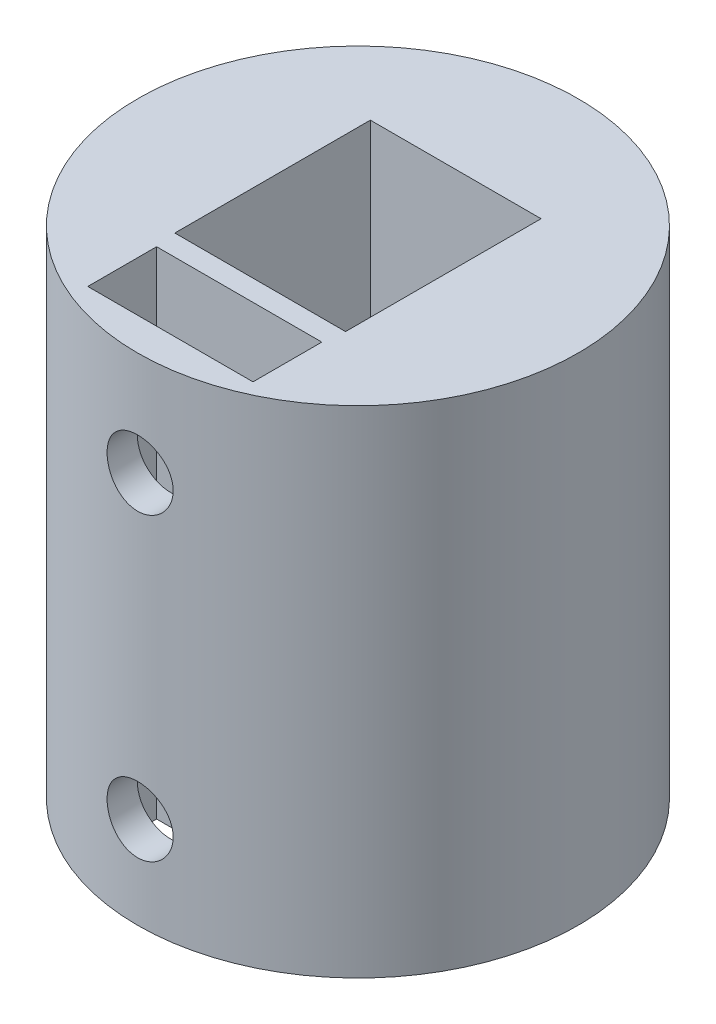
ISO-10303-21;
HEADER;
FILE_DESCRIPTION(('STEP AP214'),'2;1');
FILE_NAME('part.step','',(''),(''),'','','');
FILE_SCHEMA(('AUTOMOTIVE_DESIGN { 1 0 10303 214 1 1 1 1 }'));
ENDSEC;
DATA;
#1=APPLICATION_CONTEXT('core data for automotive mechanical design processes');
#2=APPLICATION_PROTOCOL_DEFINITION('international standard','automotive_design',2000,#1);
#3=PRODUCT_CONTEXT('',#1,'mechanical');
#4=PRODUCT('Part','Part','',(#3));
#5=PRODUCT_RELATED_PRODUCT_CATEGORY('part','',(#4));
#6=PRODUCT_DEFINITION_FORMATION('','',#4);
#7=PRODUCT_DEFINITION_CONTEXT('part definition',#1,'design');
#8=PRODUCT_DEFINITION('design','',#6,#7);
#9=PRODUCT_DEFINITION_SHAPE('','',#8);
#10=(LENGTH_UNIT() NAMED_UNIT(*) SI_UNIT(.MILLI.,.METRE.));
#11=(NAMED_UNIT(*) PLANE_ANGLE_UNIT() SI_UNIT($,.RADIAN.));
#12=(NAMED_UNIT(*) SI_UNIT($,.STERADIAN.) SOLID_ANGLE_UNIT());
#13=UNCERTAINTY_MEASURE_WITH_UNIT(LENGTH_MEASURE(1.E-05),#10,'distance_accuracy_value','');
#14=(GEOMETRIC_REPRESENTATION_CONTEXT(3) GLOBAL_UNCERTAINTY_ASSIGNED_CONTEXT((#13)) GLOBAL_UNIT_ASSIGNED_CONTEXT((#10,
#11,#12)) REPRESENTATION_CONTEXT('',''));
#15=CARTESIAN_POINT('',(0.,0.,0.));
#16=DIRECTION('',(0.,0.,1.));
#17=DIRECTION('',(1.,0.,0.));
#18=AXIS2_PLACEMENT_3D('',#15,#16,#17);
#19=CARTESIAN_POINT('',(0.,18.,0.));
#20=DIRECTION('',(0.,1.,0.));
#21=DIRECTION('',(0.,0.,1.));
#22=AXIS2_PLACEMENT_3D('',#19,#20,#21);
#23=PLANE('',#22);
#24=DIRECTION('',(0.,0.,-1.));
#25=VECTOR('',#24,1.);
#26=CARTESIAN_POINT('',(3.1,18.,-3.55));
#27=LINE('',#26,#25);
#28=CARTESIAN_POINT('',(3.1,18.,3.55));
#29=VERTEX_POINT('',#28);
#30=CARTESIAN_POINT('',(3.1,18.,-3.55));
#31=VERTEX_POINT('',#30);
#32=EDGE_CURVE('E123',#29,#31,#27,.T.);
#33=ORIENTED_EDGE('',*,*,#32,.F.);
#34=DIRECTION('',(1.,0.,0.));
#35=VECTOR('',#34,1.);
#36=CARTESIAN_POINT('',(-3.1,18.,3.55));
#37=LINE('',#36,#35);
#38=CARTESIAN_POINT('',(-3.1,18.,3.55));
#39=VERTEX_POINT('',#38);
#40=EDGE_CURVE('E158',#39,#29,#37,.T.);
#41=ORIENTED_EDGE('',*,*,#40,.F.);
#42=DIRECTION('',(0.,0.,1.));
#43=VECTOR('',#42,1.);
#44=CARTESIAN_POINT('',(-3.1,18.,-3.55));
#45=LINE('',#44,#43);
#46=CARTESIAN_POINT('',(-3.1,18.,-3.55));
#47=VERTEX_POINT('',#46);
#48=EDGE_CURVE('E172',#47,#39,#45,.T.);
#49=ORIENTED_EDGE('',*,*,#48,.F.);
#50=DIRECTION('',(-1.,0.,0.));
#51=VECTOR('',#50,1.);
#52=CARTESIAN_POINT('',(-3.1,18.,-3.55));
#53=LINE('',#52,#51);
#54=EDGE_CURVE('E169',#31,#47,#53,.T.);
#55=ORIENTED_EDGE('',*,*,#54,.F.);
#56=EDGE_LOOP('',(#33,#41,#49,#55));
#57=FACE_BOUND('',#56,.T.);
#58=CARTESIAN_POINT('',(0.,18.,0.));
#59=DIRECTION('',(0.,1.,0.));
#60=DIRECTION('',(0.,0.,1.));
#61=AXIS2_PLACEMENT_3D('',#58,#59,#60);
#62=CIRCLE('',#61,8.);
#63=CARTESIAN_POINT('',(0.,18.,8.));
#64=VERTEX_POINT('',#63);
#65=EDGE_CURVE('E202',#64,#64,#62,.T.);
#66=ORIENTED_EDGE('',*,*,#65,.T.);
#67=EDGE_LOOP('',(#66));
#68=FACE_BOUND('',#67,.T.);
#69=DIRECTION('',(-1.,0.,0.));
#70=VECTOR('',#69,1.);
#71=CARTESIAN_POINT('',(3.,18.,6.8115824668048));
#72=LINE('',#71,#70);
#73=CARTESIAN_POINT('',(3.,18.,6.8115824668048));
#74=VERTEX_POINT('',#73);
#75=CARTESIAN_POINT('',(-3.,18.,6.8115824668048));
#76=VERTEX_POINT('',#75);
#77=EDGE_CURVE('E136',#74,#76,#72,.T.);
#78=ORIENTED_EDGE('',*,*,#77,.T.);
#79=DIRECTION('',(0.,0.,-1.));
#80=VECTOR('',#79,1.);
#81=CARTESIAN_POINT('',(-3.,18.,6.8115824668048));
#82=LINE('',#81,#80);
#83=CARTESIAN_POINT('',(-3.,18.,4.3115824668048));
#84=VERTEX_POINT('',#83);
#85=EDGE_CURVE('E57',#76,#84,#82,.T.);
#86=ORIENTED_EDGE('',*,*,#85,.T.);
#87=DIRECTION('',(1.,0.,0.));
#88=VECTOR('',#87,1.);
#89=CARTESIAN_POINT('',(-3.,18.,4.3115824668048));
#90=LINE('',#89,#88);
#91=CARTESIAN_POINT('',(3.,18.,4.3115824668048));
#92=VERTEX_POINT('',#91);
#93=EDGE_CURVE('E127',#84,#92,#90,.T.);
#94=ORIENTED_EDGE('',*,*,#93,.T.);
#95=DIRECTION('',(0.,0.,1.));
#96=VECTOR('',#95,1.);
#97=CARTESIAN_POINT('',(3.,18.,4.3115824668048));
#98=LINE('',#97,#96);
#99=EDGE_CURVE('E133',#92,#74,#98,.T.);
#100=ORIENTED_EDGE('',*,*,#99,.T.);
#101=EDGE_LOOP('',(#78,#86,#94,#100));
#102=FACE_BOUND('',#101,.T.);
#103=ADVANCED_FACE('F39',(#57,#68,#102),#23,.T.);
#104=CARTESIAN_POINT('',(0.,0.,0.));
#105=DIRECTION('',(0.,1.,0.));
#106=DIRECTION('',(0.,0.,1.));
#107=AXIS2_PLACEMENT_3D('',#104,#105,#106);
#108=PLANE('',#107);
#109=CARTESIAN_POINT('',(0.,0.,0.));
#110=DIRECTION('',(0.,1.,0.));
#111=DIRECTION('',(0.,0.,1.));
#112=AXIS2_PLACEMENT_3D('',#109,#110,#111);
#113=CIRCLE('',#112,8.);
#114=CARTESIAN_POINT('',(0.,0.,8.));
#115=VERTEX_POINT('',#114);
#116=EDGE_CURVE('E199',#115,#115,#113,.T.);
#117=ORIENTED_EDGE('',*,*,#116,.F.);
#118=EDGE_LOOP('',(#117));
#119=FACE_BOUND('',#118,.T.);
#120=DIRECTION('',(-1.,0.,0.));
#121=VECTOR('',#120,1.);
#122=CARTESIAN_POINT('',(-1.50127177756507,0.,1.39595238095238));
#123=LINE('',#122,#121);
#124=CARTESIAN_POINT('',(1.50127177756507,0.,1.39595238095238));
#125=VERTEX_POINT('',#124);
#126=CARTESIAN_POINT('',(-1.50127177756507,0.,1.39595238095238));
#127=VERTEX_POINT('',#126);
#128=EDGE_CURVE('E190',#125,#127,#123,.T.);
#129=ORIENTED_EDGE('',*,*,#128,.F.);
#130=CARTESIAN_POINT('',(0.,0.,0.));
#131=DIRECTION('',(0.,-1.,0.));
#132=DIRECTION('',(0.,0.,-1.));
#133=AXIS2_PLACEMENT_3D('',#130,#131,#132);
#134=CIRCLE('',#133,2.05);
#135=EDGE_CURVE('E179',#127,#125,#134,.T.);
#136=ORIENTED_EDGE('',*,*,#135,.F.);
#137=EDGE_LOOP('',(#129,#136));
#138=FACE_BOUND('',#137,.T.);
#139=DIRECTION('',(0.,0.,-1.));
#140=VECTOR('',#139,1.);
#141=CARTESIAN_POINT('',(-3.,0.,0.));
#142=LINE('',#141,#140);
#143=CARTESIAN_POINT('',(-3.,0.,6.8115824668048));
#144=VERTEX_POINT('',#143);
#145=CARTESIAN_POINT('',(-3.,0.,4.3115824668048));
#146=VERTEX_POINT('',#145);
#147=EDGE_CURVE('E11',#144,#146,#142,.T.);
#148=ORIENTED_EDGE('',*,*,#147,.F.);
#149=DIRECTION('',(-1.,0.,0.));
#150=VECTOR('',#149,1.);
#151=CARTESIAN_POINT('',(0.,0.,6.8115824668048));
#152=LINE('',#151,#150);
#153=CARTESIAN_POINT('',(3.,0.,6.8115824668048));
#154=VERTEX_POINT('',#153);
#155=EDGE_CURVE('E205',#154,#144,#152,.T.);
#156=ORIENTED_EDGE('',*,*,#155,.F.);
#157=DIRECTION('',(0.,0.,1.));
#158=VECTOR('',#157,1.);
#159=CARTESIAN_POINT('',(3.,0.,0.));
#160=LINE('',#159,#158);
#161=CARTESIAN_POINT('',(3.,0.,4.3115824668048));
#162=VERTEX_POINT('',#161);
#163=EDGE_CURVE('E209',#162,#154,#160,.T.);
#164=ORIENTED_EDGE('',*,*,#163,.F.);
#165=DIRECTION('',(1.,0.,0.));
#166=VECTOR('',#165,1.);
#167=CARTESIAN_POINT('',(0.,0.,4.3115824668048));
#168=LINE('',#167,#166);
#169=EDGE_CURVE('E49',#146,#162,#168,.T.);
#170=ORIENTED_EDGE('',*,*,#169,.F.);
#171=EDGE_LOOP('',(#148,#156,#164,#170));
#172=FACE_BOUND('',#171,.T.);
#173=ADVANCED_FACE('F285',(#119,#138,#172),#108,.F.);
#174=CARTESIAN_POINT('',(0.,18.,0.));
#175=DIRECTION('',(0.,-1.,0.));
#176=DIRECTION('',(0.,0.,-1.));
#177=AXIS2_PLACEMENT_3D('',#174,#175,#176);
#178=CYLINDRICAL_SURFACE('',#177,8.);
#179=CARTESIAN_POINT('',(1.2,3.32833392560161,7.90948797331408));
#180=CARTESIAN_POINT('',(1.19999723285827,3.26133747016965,7.90948909334874));
#181=CARTESIAN_POINT('',(1.19437037110793,3.19430212500104,7.91034841391281));
#182=CARTESIAN_POINT('',(1.17201757325601,3.06210567369511,7.91369051842592));
#183=CARTESIAN_POINT('',(1.15528081122102,2.9969464604176,7.91617488585144));
#184=CARTESIAN_POINT('',(1.11122020878467,2.87043492124409,7.92247951188982));
#185=CARTESIAN_POINT('',(1.08390449345118,2.80907971556788,7.92629874505229));
#186=CARTESIAN_POINT('',(1.01948050470233,2.69183230098395,7.93484155290516));
#187=CARTESIAN_POINT('',(0.982373579438974,2.63593934143017,7.93956500306935));
#188=CARTESIAN_POINT('',(0.899103219348467,2.53074687219815,7.94942631398432));
#189=CARTESIAN_POINT('',(0.852876844678562,2.48149743487622,7.95456689966446));
#190=CARTESIAN_POINT('',(0.7528156843555,2.39142393707721,7.96465894535238));
#191=CARTESIAN_POINT('',(0.698980480629224,2.35060033986802,7.96961039494892));
#192=CARTESIAN_POINT('',(0.584909086442197,2.27835262024852,7.97879477942548));
#193=CARTESIAN_POINT('',(0.524643381892614,2.24697460534364,7.98302414748455));
#194=CARTESIAN_POINT('',(0.39962308008558,2.19480464655507,7.99025765397124));
#195=CARTESIAN_POINT('',(0.334868720216543,2.1740121433273,7.99326185713555));
#196=CARTESIAN_POINT('',(0.203224898472456,2.14375521477694,7.99768731838225));
#197=CARTESIAN_POINT('',(0.136355107511894,2.13420694449188,7.99912028709875));
#198=CARTESIAN_POINT('',(0.00194816321558356,2.1264491777417,8.00028195815667));
#199=CARTESIAN_POINT('',(-0.0655889528125968,2.12823905094586,8.00001075523952));
#200=CARTESIAN_POINT('',(-0.198841374560416,2.14304059581156,7.99780399728636));
#201=CARTESIAN_POINT('',(-0.264566953120006,2.1559620630348,7.99588182121983));
#202=CARTESIAN_POINT('',(-0.39290626331451,2.19251841065967,7.99060400182281));
#203=CARTESIAN_POINT('',(-0.455519914810785,2.21615356680276,7.98724832159791));
#204=CARTESIAN_POINT('',(-0.576131024616253,2.27355872313529,7.97945755098564));
#205=CARTESIAN_POINT('',(-0.634110137858877,2.3073666976886,7.97501842812511));
#206=CARTESIAN_POINT('',(-0.743606325720142,2.3841300805376,7.96555550596337));
#207=CARTESIAN_POINT('',(-0.795122974617388,2.4270860909671,7.96053166818547));
#208=CARTESIAN_POINT('',(-0.890763586178117,2.52142868466288,7.95040126554101));
#209=CARTESIAN_POINT('',(-0.934809863607573,2.5728940231777,7.94529437298605));
#210=CARTESIAN_POINT('',(-1.0136527947105,2.6825267873006,7.93562163562818));
#211=CARTESIAN_POINT('',(-1.04844939142399,2.74069425417755,7.93105579415719));
#212=CARTESIAN_POINT('',(-1.10781571627684,2.86216109595413,7.92298220229484));
#213=CARTESIAN_POINT('',(-1.13237745816065,2.92546443253152,7.91947527876233));
#214=CARTESIAN_POINT('',(-1.17049868967103,3.05536212971952,7.91393122319247));
#215=CARTESIAN_POINT('',(-1.18405895469861,3.12195625803901,7.91189398757039));
#216=CARTESIAN_POINT('',(-1.19968576069324,3.2558539972636,7.90953961116021));
#217=CARTESIAN_POINT('',(-1.20186242612042,3.32314447616284,7.90920599042059));
#218=CARTESIAN_POINT('',(-1.19495245615855,3.45712928145548,7.91025286349722));
#219=CARTESIAN_POINT('',(-1.18586617025842,3.52382362628222,7.91163330412623));
#220=CARTESIAN_POINT('',(-1.15678162362213,3.65438177997412,7.91593761969162));
#221=CARTESIAN_POINT('',(-1.13683822822257,3.71825808955489,7.91885373186286));
#222=CARTESIAN_POINT('',(-1.08666265557669,3.8417611992405,7.92589441460614));
#223=CARTESIAN_POINT('',(-1.05642997021111,3.90138778930417,7.93001904485741));
#224=CARTESIAN_POINT('',(-0.986269423962588,4.01519253386965,7.9390508454965));
#225=CARTESIAN_POINT('',(-0.946270276494129,4.06932628342547,7.9439636742399));
#226=CARTESIAN_POINT('',(-0.857811334697611,4.17015221350066,7.95400127546684));
#227=CARTESIAN_POINT('',(-0.809351061957436,4.21684397294653,7.95912605992234));
#228=CARTESIAN_POINT('',(-0.704860495702547,4.30185601090848,7.96906164173909));
#229=CARTESIAN_POINT('',(-0.648770501417565,4.34010330819559,7.97386946768339));
#230=CARTESIAN_POINT('',(-0.530897664210944,4.40663224981173,7.98258324025612));
#231=CARTESIAN_POINT('',(-0.469114977088351,4.43491416677363,7.9864892115565));
#232=CARTESIAN_POINT('',(-0.341838396688917,4.48059291959204,7.99294615728636));
#233=CARTESIAN_POINT('',(-0.276359087003442,4.4980296592643,7.99550209374319));
#234=CARTESIAN_POINT('',(-0.143360652400955,4.52165222923159,7.99899181325517));
#235=CARTESIAN_POINT('',(-0.0758416625044652,4.52783880260093,7.99992570344641));
#236=CARTESIAN_POINT('',(0.0586116726886539,4.52876728924114,8.00006503247314));
#237=CARTESIAN_POINT('',(0.125545256169641,4.52362087030319,7.99928733619037));
#238=CARTESIAN_POINT('',(0.257583836258485,4.50226881486501,7.99612488415313));
#239=CARTESIAN_POINT('',(0.322688838717209,4.48606321375476,7.99374013354133));
#240=CARTESIAN_POINT('',(0.449191499503728,4.44309242514542,7.98763029393971));
#241=CARTESIAN_POINT('',(0.510591834519026,4.41633496949047,7.98390618653558));
#242=CARTESIAN_POINT('',(0.628048894317282,4.3530319352151,7.975526675964));
#243=CARTESIAN_POINT('',(0.684105445536567,4.31648603881734,7.9708712425627));
#244=CARTESIAN_POINT('',(0.789850068153566,4.23423976653827,7.96109208508942));
#245=CARTESIAN_POINT('',(0.839473653157105,4.18845694494854,7.95596438740753));
#246=CARTESIAN_POINT('',(0.930374467122141,4.08920986713724,7.94584801351201));
#247=CARTESIAN_POINT('',(0.971649734391869,4.03574381054214,7.94085937021033));
#248=CARTESIAN_POINT('',(1.04489048658379,3.92229473901558,7.93155587223293));
#249=CARTESIAN_POINT('',(1.07680235432967,3.86227679198415,7.92724496125588));
#250=CARTESIAN_POINT('',(1.13004491097636,3.73769650419097,7.91983127288579));
#251=CARTESIAN_POINT('',(1.15138658059918,3.67313895931536,7.91672724246345));
#252=CARTESIAN_POINT('',(1.17803961512021,3.56163197659643,7.9127958841986));
#253=CARTESIAN_POINT('',(1.18626215824336,3.5153712080622,7.91156199505904));
#254=CARTESIAN_POINT('',(1.19724328461259,3.42219129221413,7.90990765253609));
#255=CARTESIAN_POINT('',(1.20000193868061,3.37527215344192,7.90948718860924));
#256=CARTESIAN_POINT('',(1.2,3.32833392560161,7.90948797331408));
#257=B_SPLINE_CURVE_WITH_KNOTS('',3,(#179,#180,#181,#182,#183,#184,#185,#186,#187,#188,#189,
#190,#191,#192,#193,#194,#195,#196,#197,#198,#199,#200,#201,#202,#203,#204,#205,#206,#207,#208,
#209,#210,#211,#212,#213,#214,#215,#216,#217,#218,#219,#220,#221,#222,#223,#224,#225,#226,#227,
#228,#229,#230,#231,#232,#233,#234,#235,#236,#237,#238,#239,#240,#241,#242,#243,#244,#245,#246,
#247,#248,#249,#250,#251,#252,#253,#254,#255,#256),.UNSPECIFIED.,.T.,.F.,(4,2,2,2,2,2,2,2,2,2,2,
2,2,2,2,2,2,2,2,2,2,2,2,2,2,2,2,2,2,2,2,2,2,2,2,2,2,2,4),(0.,0.200817801443894,
0.401831575649441,0.602691268268539,0.80352331892906,1.00579326919286,1.20807433766254,
1.41132737684626,1.614569674916,1.81628666027517,2.01799243151499,2.21807890012582,
2.41817051871521,2.61901853109163,2.81987976759418,3.02271635733015,3.2255541961148,
3.42855001418511,3.63153152355473,3.83254571682995,4.03355367279934,4.23355515845899,
4.43356652228893,4.63508388801042,4.83661265169441,5.03982030202813,5.24302239257483,
5.44547232712872,5.64790888936378,5.84835970897861,6.04880988714258,6.24911345806266,
6.44942353253685,6.65160760008775,6.85383912189489,7.05720703059945,7.2603632275645,
7.4010595351329,7.54175401900953),.UNSPECIFIED.);
#258=CARTESIAN_POINT('',(1.2,3.32833392560161,7.90948797331408));
#259=VERTEX_POINT('',#258);
#260=EDGE_CURVE('E137',#259,#259,#257,.T.);
#261=ORIENTED_EDGE('',*,*,#260,.T.);
#262=EDGE_LOOP('',(#261));
#263=FACE_BOUND('',#262,.T.);
#264=CARTESIAN_POINT('',(1.2,14.2257630941174,7.90948797331408));
#265=CARTESIAN_POINT('',(1.19999723285827,14.1587666386854,7.90948909334874));
#266=CARTESIAN_POINT('',(1.19437037110793,14.0917312935168,7.91034841391281));
#267=CARTESIAN_POINT('',(1.17201757325601,13.9595348422109,7.91369051842592));
#268=CARTESIAN_POINT('',(1.15528081122102,13.8943756289334,7.91617488585144));
#269=CARTESIAN_POINT('',(1.11122020878467,13.7678640897599,7.92247951188982));
#270=CARTESIAN_POINT('',(1.08390449345118,13.7065088840837,7.92629874505229));
#271=CARTESIAN_POINT('',(1.01948050470233,13.5892614694997,7.93484155290516));
#272=CARTESIAN_POINT('',(0.982373579438975,13.5333685099459,7.93956500306935));
#273=CARTESIAN_POINT('',(0.899103219348468,13.4281760407139,7.94942631398432));
#274=CARTESIAN_POINT('',(0.852876844678562,13.378926603392,7.95456689966446));
#275=CARTESIAN_POINT('',(0.7528156843555,13.288853105593,7.96465894535238));
#276=CARTESIAN_POINT('',(0.698980480629224,13.2480295083838,7.96961039494892));
#277=CARTESIAN_POINT('',(0.584909086442196,13.1757817887643,7.97879477942548));
#278=CARTESIAN_POINT('',(0.524643381892613,13.1444037738594,7.98302414748455));
#279=CARTESIAN_POINT('',(0.399623080085579,13.0922338150708,7.99025765397124));
#280=CARTESIAN_POINT('',(0.334868720216542,13.0714413118431,7.99326185713555));
#281=CARTESIAN_POINT('',(0.203224898472456,13.0411843832927,7.99768731838225));
#282=CARTESIAN_POINT('',(0.136355107511893,13.0316361130077,7.99912028709875));
#283=CARTESIAN_POINT('',(0.00194816321558344,13.0238783462575,8.00028195815667));
#284=CARTESIAN_POINT('',(-0.0655889528125968,13.0256682194616,8.00001075523952));
#285=CARTESIAN_POINT('',(-0.198841374560416,13.0404697643273,7.99780399728636));
#286=CARTESIAN_POINT('',(-0.264566953120006,13.0533912315506,7.99588182121983));
#287=CARTESIAN_POINT('',(-0.39290626331451,13.0899475791754,7.99060400182281));
#288=CARTESIAN_POINT('',(-0.455519914810785,13.1135827353185,7.98724832159791));
#289=CARTESIAN_POINT('',(-0.576131024616254,13.1709878916511,7.97945755098564));
#290=CARTESIAN_POINT('',(-0.634110137858878,13.2047958662044,7.97501842812511));
#291=CARTESIAN_POINT('',(-0.743606325720143,13.2815592490534,7.96555550596337));
#292=CARTESIAN_POINT('',(-0.795122974617388,13.3245152594829,7.96053166818547));
#293=CARTESIAN_POINT('',(-0.890763586178117,13.4188578531787,7.95040126554101));
#294=CARTESIAN_POINT('',(-0.934809863607574,13.4703231916935,7.94529437298605));
#295=CARTESIAN_POINT('',(-1.0136527947105,13.5799559558164,7.93562163562818));
#296=CARTESIAN_POINT('',(-1.04844939142399,13.6381234226933,7.93105579415719));
#297=CARTESIAN_POINT('',(-1.10781571627684,13.7595902644699,7.92298220229484));
#298=CARTESIAN_POINT('',(-1.13237745816065,13.8228936010473,7.91947527876233));
#299=CARTESIAN_POINT('',(-1.17049868967103,13.9527912982353,7.91393122319247));
#300=CARTESIAN_POINT('',(-1.18405895469861,14.0193854265548,7.91189398757039));
#301=CARTESIAN_POINT('',(-1.19968576069324,14.1532831657794,7.90953961116021));
#302=CARTESIAN_POINT('',(-1.20186242612042,14.2205736446786,7.90920599042059));
#303=CARTESIAN_POINT('',(-1.19495245615855,14.3545584499713,7.91025286349722));
#304=CARTESIAN_POINT('',(-1.18586617025842,14.421252794798,7.91163330412623));
#305=CARTESIAN_POINT('',(-1.15678162362213,14.5518109484899,7.91593761969162));
#306=CARTESIAN_POINT('',(-1.13683822822257,14.6156872580707,7.91885373186286));
#307=CARTESIAN_POINT('',(-1.08666265557669,14.7391903677563,7.92589441460614));
#308=CARTESIAN_POINT('',(-1.05642997021111,14.7988169578199,7.93001904485741));
#309=CARTESIAN_POINT('',(-0.986269423962588,14.9126217023854,7.9390508454965));
#310=CARTESIAN_POINT('',(-0.946270276494129,14.9667554519412,7.9439636742399));
#311=CARTESIAN_POINT('',(-0.857811334697611,15.0675813820164,7.95400127546684));
#312=CARTESIAN_POINT('',(-0.809351061957437,15.1142731414623,7.95912605992234));
#313=CARTESIAN_POINT('',(-0.704860495702547,15.1992851794242,7.96906164173909));
#314=CARTESIAN_POINT('',(-0.648770501417566,15.2375324767114,7.97386946768339));
#315=CARTESIAN_POINT('',(-0.530897664210945,15.3040614183275,7.98258324025612));
#316=CARTESIAN_POINT('',(-0.469114977088351,15.3323433352894,7.9864892115565));
#317=CARTESIAN_POINT('',(-0.341838396688917,15.3780220881078,7.99294615728636));
#318=CARTESIAN_POINT('',(-0.276359087003441,15.3954588277801,7.99550209374319));
#319=CARTESIAN_POINT('',(-0.143360652400954,15.4190813977474,7.99899181325517));
#320=CARTESIAN_POINT('',(-0.0758416625044638,15.4252679711167,7.99992570344641));
#321=CARTESIAN_POINT('',(0.058611672688656,15.4261964577569,8.00006503247314));
#322=CARTESIAN_POINT('',(0.125545256169643,15.421050038819,7.99928733619037));
#323=CARTESIAN_POINT('',(0.257583836258487,15.3996979833808,7.99612488415313));
#324=CARTESIAN_POINT('',(0.322688838717211,15.3834923822705,7.99374013354133));
#325=CARTESIAN_POINT('',(0.449191499503729,15.3405215936612,7.98763029393971));
#326=CARTESIAN_POINT('',(0.510591834519026,15.3137641380062,7.98390618653557));
#327=CARTESIAN_POINT('',(0.628048894317282,15.2504611037309,7.97552667596399));
#328=CARTESIAN_POINT('',(0.684105445536567,15.2139152073331,7.9708712425627));
#329=CARTESIAN_POINT('',(0.789850068153568,15.131668935054,7.96109208508942));
#330=CARTESIAN_POINT('',(0.839473653157107,15.0858861134643,7.95596438740753));
#331=CARTESIAN_POINT('',(0.930374467122142,14.986639035653,7.94584801351201));
#332=CARTESIAN_POINT('',(0.97164973439187,14.9331729790579,7.94085937021033));
#333=CARTESIAN_POINT('',(1.04489048658379,14.8197239075314,7.93155587223293));
#334=CARTESIAN_POINT('',(1.07680235432967,14.7597059604999,7.92724496125588));
#335=CARTESIAN_POINT('',(1.13004491097636,14.6351256727067,7.91983127288579));
#336=CARTESIAN_POINT('',(1.15138658059918,14.5705681278311,7.91672724246345));
#337=CARTESIAN_POINT('',(1.17803961512021,14.4590611451122,7.9127958841986));
#338=CARTESIAN_POINT('',(1.18626215824336,14.412800376578,7.91156199505904));
#339=CARTESIAN_POINT('',(1.19724328461259,14.3196204607299,7.90990765253609));
#340=CARTESIAN_POINT('',(1.20000193868061,14.2727013219577,7.90948718860924));
#341=CARTESIAN_POINT('',(1.2,14.2257630941174,7.90948797331408));
#342=B_SPLINE_CURVE_WITH_KNOTS('',3,(#264,#265,#266,#267,#268,#269,#270,#271,#272,#273,#274,
#275,#276,#277,#278,#279,#280,#281,#282,#283,#284,#285,#286,#287,#288,#289,#290,#291,#292,#293,
#294,#295,#296,#297,#298,#299,#300,#301,#302,#303,#304,#305,#306,#307,#308,#309,#310,#311,#312,
#313,#314,#315,#316,#317,#318,#319,#320,#321,#322,#323,#324,#325,#326,#327,#328,#329,#330,#331,
#332,#333,#334,#335,#336,#337,#338,#339,#340,#341),.UNSPECIFIED.,.T.,.F.,(4,2,2,2,2,2,2,2,2,2,2,
2,2,2,2,2,2,2,2,2,2,2,2,2,2,2,2,2,2,2,2,2,2,2,2,2,2,2,4),(0.,0.200817801443894,
0.401831575649441,0.602691268268538,0.803523318929059,1.00579326919286,1.20807433766254,
1.41132737684626,1.614569674916,1.81628666027517,2.01799243151499,2.21807890012582,
2.41817051871521,2.61901853109163,2.81987976759418,3.02271635733016,3.2255541961148,
3.42855001418511,3.63153152355473,3.83254571682995,4.03355367279934,4.23355515845899,
4.43356652228894,4.63508388801042,4.83661265169441,5.03982030202813,5.24302239257483,
5.44547232712872,5.64790888936378,5.84835970897861,6.04880988714258,6.24911345806266,
6.44942353253685,6.65160760008775,6.8538391218949,7.05720703059945,7.26036322756451,
7.40105953513291,7.54175401900954),.UNSPECIFIED.);
#343=CARTESIAN_POINT('',(1.2,14.2257630941174,7.90948797331408));
#344=VERTEX_POINT('',#343);
#345=EDGE_CURVE('E222',#344,#344,#342,.T.);
#346=ORIENTED_EDGE('',*,*,#345,.T.);
#347=EDGE_LOOP('',(#346));
#348=FACE_BOUND('',#347,.T.);
#349=ORIENTED_EDGE('',*,*,#65,.F.);
#350=EDGE_LOOP('',(#349));
#351=FACE_BOUND('',#350,.T.);
#352=ORIENTED_EDGE('',*,*,#116,.T.);
#353=EDGE_LOOP('',(#352));
#354=FACE_BOUND('',#353,.T.);
#355=ADVANCED_FACE('F41',(#263,#348,#351,#354),#178,.T.);
#356=CARTESIAN_POINT('',(0.,8.,0.));
#357=DIRECTION('',(0.,-1.,0.));
#358=DIRECTION('',(0.,0.,-1.));
#359=AXIS2_PLACEMENT_3D('',#356,#357,#358);
#360=CYLINDRICAL_SURFACE('',#359,2.05);
#361=ORIENTED_EDGE('',*,*,#135,.T.);
#362=DIRECTION('',(0.,-1.,0.));
#363=VECTOR('',#362,1.);
#364=CARTESIAN_POINT('',(1.50127177756507,8.,1.39595238095238));
#365=LINE('',#364,#363);
#366=CARTESIAN_POINT('',(1.50127177756507,8.,1.39595238095238));
#367=VERTEX_POINT('',#366);
#368=EDGE_CURVE('E193',#367,#125,#365,.T.);
#369=ORIENTED_EDGE('',*,*,#368,.F.);
#370=CARTESIAN_POINT('',(0.,8.,0.));
#371=DIRECTION('',(0.,-1.,0.));
#372=DIRECTION('',(0.,0.,-1.));
#373=AXIS2_PLACEMENT_3D('',#370,#371,#372);
#374=CIRCLE('',#373,2.05);
#375=CARTESIAN_POINT('',(-1.50127177756507,8.,1.39595238095238));
#376=VERTEX_POINT('',#375);
#377=EDGE_CURVE('E186',#376,#367,#374,.T.);
#378=ORIENTED_EDGE('',*,*,#377,.F.);
#379=DIRECTION('',(0.,-1.,0.));
#380=VECTOR('',#379,1.);
#381=CARTESIAN_POINT('',(-1.50127177756507,8.,1.39595238095238));
#382=LINE('',#381,#380);
#383=EDGE_CURVE('E197',#376,#127,#382,.T.);
#384=ORIENTED_EDGE('',*,*,#383,.T.);
#385=EDGE_LOOP('',(#361,#369,#378,#384));
#386=FACE_BOUND('',#385,.T.);
#387=ADVANCED_FACE('F279',(#386),#360,.F.);
#388=CARTESIAN_POINT('',(-1.50127177756507,8.,1.39595238095238));
#389=DIRECTION('',(0.,0.,1.));
#390=DIRECTION('',(1.,0.,0.));
#391=AXIS2_PLACEMENT_3D('',#388,#389,#390);
#392=PLANE('',#391);
#393=CARTESIAN_POINT('',(0.,3.32833392560161,1.39595238095238));
#394=DIRECTION('',(0.,0.,1.));
#395=DIRECTION('',(1.,0.,0.));
#396=AXIS2_PLACEMENT_3D('',#393,#394,#395);
#397=CIRCLE('',#396,1.2);
#398=CARTESIAN_POINT('',(1.2,3.32833392560161,1.39595238095238));
#399=VERTEX_POINT('',#398);
#400=EDGE_CURVE('E140',#399,#399,#397,.T.);
#401=ORIENTED_EDGE('',*,*,#400,.T.);
#402=EDGE_LOOP('',(#401));
#403=FACE_BOUND('',#402,.T.);
#404=ORIENTED_EDGE('',*,*,#128,.T.);
#405=ORIENTED_EDGE('',*,*,#383,.F.);
#406=DIRECTION('',(-1.,0.,0.));
#407=VECTOR('',#406,1.);
#408=CARTESIAN_POINT('',(-1.50127177756507,8.,1.39595238095238));
#409=LINE('',#408,#407);
#410=EDGE_CURVE('E189',#367,#376,#409,.T.);
#411=ORIENTED_EDGE('',*,*,#410,.F.);
#412=ORIENTED_EDGE('',*,*,#368,.T.);
#413=EDGE_LOOP('',(#404,#405,#411,#412));
#414=FACE_BOUND('',#413,.T.);
#415=ADVANCED_FACE('F275',(#403,#414),#392,.F.);
#416=CARTESIAN_POINT('',(0.,8.,0.));
#417=DIRECTION('',(0.,-1.,0.));
#418=DIRECTION('',(0.,0.,-1.));
#419=AXIS2_PLACEMENT_3D('',#416,#417,#418);
#420=PLANE('',#419);
#421=ORIENTED_EDGE('',*,*,#377,.T.);
#422=ORIENTED_EDGE('',*,*,#410,.T.);
#423=EDGE_LOOP('',(#421,#422));
#424=FACE_BOUND('',#423,.T.);
#425=ADVANCED_FACE('F271',(#424),#420,.T.);
#426=CARTESIAN_POINT('',(3.1,10.,-3.55));
#427=DIRECTION('',(1.,0.,0.));
#428=DIRECTION('',(0.,0.,-1.));
#429=AXIS2_PLACEMENT_3D('',#426,#427,#428);
#430=PLANE('',#429);
#431=ORIENTED_EDGE('',*,*,#32,.T.);
#432=DIRECTION('',(0.,1.,0.));
#433=VECTOR('',#432,1.);
#434=CARTESIAN_POINT('',(3.1,10.,-3.55));
#435=LINE('',#434,#433);
#436=CARTESIAN_POINT('',(3.1,10.,-3.55));
#437=VERTEX_POINT('',#436);
#438=EDGE_CURVE('E167',#437,#31,#435,.T.);
#439=ORIENTED_EDGE('',*,*,#438,.F.);
#440=DIRECTION('',(0.,0.,-1.));
#441=VECTOR('',#440,1.);
#442=CARTESIAN_POINT('',(3.1,10.,-3.55));
#443=LINE('',#442,#441);
#444=CARTESIAN_POINT('',(3.1,10.,3.55));
#445=VERTEX_POINT('',#444);
#446=EDGE_CURVE('E154',#445,#437,#443,.T.);
#447=ORIENTED_EDGE('',*,*,#446,.F.);
#448=DIRECTION('',(0.,1.,0.));
#449=VECTOR('',#448,1.);
#450=CARTESIAN_POINT('',(3.1,10.,3.55));
#451=LINE('',#450,#449);
#452=EDGE_CURVE('E177',#445,#29,#451,.T.);
#453=ORIENTED_EDGE('',*,*,#452,.T.);
#454=EDGE_LOOP('',(#431,#439,#447,#453));
#455=FACE_BOUND('',#454,.T.);
#456=ADVANCED_FACE('F261',(#455),#430,.F.);
#457=CARTESIAN_POINT('',(-3.1,10.,3.55));
#458=DIRECTION('',(0.,0.,1.));
#459=DIRECTION('',(1.,0.,0.));
#460=AXIS2_PLACEMENT_3D('',#457,#458,#459);
#461=PLANE('',#460);
#462=CARTESIAN_POINT('',(0.,14.2257630941174,3.55));
#463=DIRECTION('',(0.,0.,1.));
#464=DIRECTION('',(1.,0.,0.));
#465=AXIS2_PLACEMENT_3D('',#462,#463,#464);
#466=CIRCLE('',#465,1.2);
#467=CARTESIAN_POINT('',(1.2,14.2257630941174,3.55));
#468=VERTEX_POINT('',#467);
#469=EDGE_CURVE('E217',#468,#468,#466,.T.);
#470=ORIENTED_EDGE('',*,*,#469,.T.);
#471=EDGE_LOOP('',(#470));
#472=FACE_BOUND('',#471,.T.);
#473=ORIENTED_EDGE('',*,*,#40,.T.);
#474=ORIENTED_EDGE('',*,*,#452,.F.);
#475=DIRECTION('',(1.,0.,0.));
#476=VECTOR('',#475,1.);
#477=CARTESIAN_POINT('',(-3.1,10.,3.55));
#478=LINE('',#477,#476);
#479=CARTESIAN_POINT('',(-3.1,10.,3.55));
#480=VERTEX_POINT('',#479);
#481=EDGE_CURVE('E164',#480,#445,#478,.T.);
#482=ORIENTED_EDGE('',*,*,#481,.F.);
#483=DIRECTION('',(0.,1.,0.));
#484=VECTOR('',#483,1.);
#485=CARTESIAN_POINT('',(-3.1,10.,3.55));
#486=LINE('',#485,#484);
#487=EDGE_CURVE('E180',#480,#39,#486,.T.);
#488=ORIENTED_EDGE('',*,*,#487,.T.);
#489=EDGE_LOOP('',(#473,#474,#482,#488));
#490=FACE_BOUND('',#489,.T.);
#491=ADVANCED_FACE('F257',(#472,#490),#461,.F.);
#492=CARTESIAN_POINT('',(-3.1,10.,-3.55));
#493=DIRECTION('',(-1.,0.,0.));
#494=DIRECTION('',(0.,0.,1.));
#495=AXIS2_PLACEMENT_3D('',#492,#493,#494);
#496=PLANE('',#495);
#497=ORIENTED_EDGE('',*,*,#48,.T.);
#498=ORIENTED_EDGE('',*,*,#487,.F.);
#499=DIRECTION('',(0.,0.,1.));
#500=VECTOR('',#499,1.);
#501=CARTESIAN_POINT('',(-3.1,10.,-3.55));
#502=LINE('',#501,#500);
#503=CARTESIAN_POINT('',(-3.1,10.,-3.55));
#504=VERTEX_POINT('',#503);
#505=EDGE_CURVE('E161',#504,#480,#502,.T.);
#506=ORIENTED_EDGE('',*,*,#505,.F.);
#507=DIRECTION('',(0.,1.,0.));
#508=VECTOR('',#507,1.);
#509=CARTESIAN_POINT('',(-3.1,10.,-3.55));
#510=LINE('',#509,#508);
#511=EDGE_CURVE('E182',#504,#47,#510,.T.);
#512=ORIENTED_EDGE('',*,*,#511,.T.);
#513=EDGE_LOOP('',(#497,#498,#506,#512));
#514=FACE_BOUND('',#513,.T.);
#515=ADVANCED_FACE('F260',(#514),#496,.F.);
#516=CARTESIAN_POINT('',(-3.1,10.,-3.55));
#517=DIRECTION('',(0.,0.,-1.));
#518=DIRECTION('',(-1.,0.,0.));
#519=AXIS2_PLACEMENT_3D('',#516,#517,#518);
#520=PLANE('',#519);
#521=ORIENTED_EDGE('',*,*,#54,.T.);
#522=ORIENTED_EDGE('',*,*,#511,.F.);
#523=DIRECTION('',(-1.,0.,0.));
#524=VECTOR('',#523,1.);
#525=CARTESIAN_POINT('',(-3.1,10.,-3.55));
#526=LINE('',#525,#524);
#527=EDGE_CURVE('E157',#437,#504,#526,.T.);
#528=ORIENTED_EDGE('',*,*,#527,.F.);
#529=ORIENTED_EDGE('',*,*,#438,.T.);
#530=EDGE_LOOP('',(#521,#522,#528,#529));
#531=FACE_BOUND('',#530,.T.);
#532=ADVANCED_FACE('F255',(#531),#520,.F.);
#533=CARTESIAN_POINT('',(0.,10.,0.));
#534=DIRECTION('',(0.,1.,0.));
#535=DIRECTION('',(0.,0.,1.));
#536=AXIS2_PLACEMENT_3D('',#533,#534,#535);
#537=PLANE('',#536);
#538=ORIENTED_EDGE('',*,*,#446,.T.);
#539=ORIENTED_EDGE('',*,*,#527,.T.);
#540=ORIENTED_EDGE('',*,*,#505,.T.);
#541=ORIENTED_EDGE('',*,*,#481,.T.);
#542=EDGE_LOOP('',(#538,#539,#540,#541));
#543=FACE_BOUND('',#542,.T.);
#544=ADVANCED_FACE('F252',(#543),#537,.T.);
#545=CARTESIAN_POINT('',(-3.,-2.00000000000001,6.8115824668048));
#546=DIRECTION('',(1.,0.,0.));
#547=DIRECTION('',(0.,0.,-1.));
#548=AXIS2_PLACEMENT_3D('',#545,#546,#547);
#549=PLANE('',#548);
#550=ORIENTED_EDGE('',*,*,#147,.T.);
#551=DIRECTION('',(0.,1.,0.));
#552=VECTOR('',#551,1.);
#553=CARTESIAN_POINT('',(-3.,-2.00000000000001,4.3115824668048));
#554=LINE('',#553,#552);
#555=EDGE_CURVE('E117',#146,#84,#554,.T.);
#556=ORIENTED_EDGE('',*,*,#555,.T.);
#557=ORIENTED_EDGE('',*,*,#85,.F.);
#558=DIRECTION('',(0.,1.,0.));
#559=VECTOR('',#558,1.);
#560=CARTESIAN_POINT('',(-3.,-2.00000000000001,6.8115824668048));
#561=LINE('',#560,#559);
#562=EDGE_CURVE('E150',#144,#76,#561,.T.);
#563=ORIENTED_EDGE('',*,*,#562,.F.);
#564=EDGE_LOOP('',(#550,#556,#557,#563));
#565=FACE_BOUND('',#564,.T.);
#566=ADVANCED_FACE('F119',(#565),#549,.T.);
#567=CARTESIAN_POINT('',(-3.,-2.00000000000001,4.3115824668048));
#568=DIRECTION('',(0.,0.,1.));
#569=DIRECTION('',(1.,0.,0.));
#570=AXIS2_PLACEMENT_3D('',#567,#568,#569);
#571=PLANE('',#570);
#572=CARTESIAN_POINT('',(0.,3.32833392560161,4.3115824668048));
#573=DIRECTION('',(0.,0.,1.));
#574=DIRECTION('',(1.,0.,0.));
#575=AXIS2_PLACEMENT_3D('',#572,#573,#574);
#576=CIRCLE('',#575,1.2);
#577=CARTESIAN_POINT('',(1.2,3.32833392560161,4.3115824668048));
#578=VERTEX_POINT('',#577);
#579=EDGE_CURVE('E231',#578,#578,#576,.T.);
#580=ORIENTED_EDGE('',*,*,#579,.F.);
#581=EDGE_LOOP('',(#580));
#582=FACE_BOUND('',#581,.T.);
#583=CARTESIAN_POINT('',(0.,14.2257630941174,4.3115824668048));
#584=DIRECTION('',(0.,0.,1.));
#585=DIRECTION('',(1.,0.,0.));
#586=AXIS2_PLACEMENT_3D('',#583,#584,#585);
#587=CIRCLE('',#586,1.2);
#588=CARTESIAN_POINT('',(1.2,14.2257630941174,4.3115824668048));
#589=VERTEX_POINT('',#588);
#590=EDGE_CURVE('E213',#589,#589,#587,.T.);
#591=ORIENTED_EDGE('',*,*,#590,.F.);
#592=EDGE_LOOP('',(#591));
#593=FACE_BOUND('',#592,.T.);
#594=ORIENTED_EDGE('',*,*,#169,.T.);
#595=DIRECTION('',(0.,1.,0.));
#596=VECTOR('',#595,1.);
#597=CARTESIAN_POINT('',(3.,-2.00000000000001,4.3115824668048));
#598=LINE('',#597,#596);
#599=EDGE_CURVE('E124',#162,#92,#598,.T.);
#600=ORIENTED_EDGE('',*,*,#599,.T.);
#601=ORIENTED_EDGE('',*,*,#93,.F.);
#602=ORIENTED_EDGE('',*,*,#555,.F.);
#603=EDGE_LOOP('',(#594,#600,#601,#602));
#604=FACE_BOUND('',#603,.T.);
#605=ADVANCED_FACE('F128',(#582,#593,#604),#571,.T.);
#606=CARTESIAN_POINT('',(3.,-2.00000000000001,4.3115824668048));
#607=DIRECTION('',(-1.,0.,0.));
#608=DIRECTION('',(0.,0.,1.));
#609=AXIS2_PLACEMENT_3D('',#606,#607,#608);
#610=PLANE('',#609);
#611=ORIENTED_EDGE('',*,*,#163,.T.);
#612=DIRECTION('',(0.,1.,0.));
#613=VECTOR('',#612,1.);
#614=CARTESIAN_POINT('',(3.,-2.00000000000001,6.8115824668048));
#615=LINE('',#614,#613);
#616=EDGE_CURVE('E65',#154,#74,#615,.T.);
#617=ORIENTED_EDGE('',*,*,#616,.T.);
#618=ORIENTED_EDGE('',*,*,#99,.F.);
#619=ORIENTED_EDGE('',*,*,#599,.F.);
#620=EDGE_LOOP('',(#611,#617,#618,#619));
#621=FACE_BOUND('',#620,.T.);
#622=ADVANCED_FACE('F242',(#621),#610,.T.);
#623=CARTESIAN_POINT('',(3.,-2.00000000000001,6.8115824668048));
#624=DIRECTION('',(0.,0.,-1.));
#625=DIRECTION('',(-1.,0.,0.));
#626=AXIS2_PLACEMENT_3D('',#623,#624,#625);
#627=PLANE('',#626);
#628=CARTESIAN_POINT('',(0.,3.32833392560161,6.8115824668048));
#629=DIRECTION('',(0.,0.,-1.));
#630=DIRECTION('',(-1.,0.,0.));
#631=AXIS2_PLACEMENT_3D('',#628,#629,#630);
#632=CIRCLE('',#631,1.2);
#633=CARTESIAN_POINT('',(-1.2,3.32833392560161,6.8115824668048));
#634=VERTEX_POINT('',#633);
#635=EDGE_CURVE('E44',#634,#634,#632,.T.);
#636=ORIENTED_EDGE('',*,*,#635,.F.);
#637=EDGE_LOOP('',(#636));
#638=FACE_BOUND('',#637,.T.);
#639=CARTESIAN_POINT('',(0.,14.2257630941174,6.8115824668048));
#640=DIRECTION('',(0.,0.,-1.));
#641=DIRECTION('',(-1.,0.,0.));
#642=AXIS2_PLACEMENT_3D('',#639,#640,#641);
#643=CIRCLE('',#642,1.2);
#644=CARTESIAN_POINT('',(-1.2,14.2257630941174,6.8115824668048));
#645=VERTEX_POINT('',#644);
#646=EDGE_CURVE('E211',#645,#645,#643,.T.);
#647=ORIENTED_EDGE('',*,*,#646,.F.);
#648=EDGE_LOOP('',(#647));
#649=FACE_BOUND('',#648,.T.);
#650=ORIENTED_EDGE('',*,*,#155,.T.);
#651=ORIENTED_EDGE('',*,*,#562,.T.);
#652=ORIENTED_EDGE('',*,*,#77,.F.);
#653=ORIENTED_EDGE('',*,*,#616,.F.);
#654=EDGE_LOOP('',(#650,#651,#652,#653));
#655=FACE_BOUND('',#654,.T.);
#656=ADVANCED_FACE('F237',(#638,#649,#655),#627,.T.);
#657=CARTESIAN_POINT('',(0.,14.2257630941174,-1.));
#658=DIRECTION('',(0.,0.,1.));
#659=DIRECTION('',(1.,0.,0.));
#660=AXIS2_PLACEMENT_3D('',#657,#658,#659);
#661=CYLINDRICAL_SURFACE('',#660,1.2);
#662=ORIENTED_EDGE('',*,*,#646,.T.);
#663=EDGE_LOOP('',(#662));
#664=FACE_BOUND('',#663,.T.);
#665=ORIENTED_EDGE('',*,*,#345,.F.);
#666=EDGE_LOOP('',(#665));
#667=FACE_BOUND('',#666,.T.);
#668=ADVANCED_FACE('F232',(#664,#667),#661,.F.);
#669=CARTESIAN_POINT('',(0.,3.32833392560161,-1.));
#670=DIRECTION('',(0.,0.,1.));
#671=DIRECTION('',(1.,0.,0.));
#672=AXIS2_PLACEMENT_3D('',#669,#670,#671);
#673=CYLINDRICAL_SURFACE('',#672,1.2);
#674=ORIENTED_EDGE('',*,*,#635,.T.);
#675=EDGE_LOOP('',(#674));
#676=FACE_BOUND('',#675,.T.);
#677=ORIENTED_EDGE('',*,*,#260,.F.);
#678=EDGE_LOOP('',(#677));
#679=FACE_BOUND('',#678,.T.);
#680=ADVANCED_FACE('F236',(#676,#679),#673,.F.);
#681=ORIENTED_EDGE('',*,*,#590,.T.);
#682=EDGE_LOOP('',(#681));
#683=FACE_BOUND('',#682,.T.);
#684=ORIENTED_EDGE('',*,*,#469,.F.);
#685=EDGE_LOOP('',(#684));
#686=FACE_BOUND('',#685,.T.);
#687=ADVANCED_FACE('F238',(#683,#686),#661,.F.);
#688=ORIENTED_EDGE('',*,*,#579,.T.);
#689=EDGE_LOOP('',(#688));
#690=FACE_BOUND('',#689,.T.);
#691=ORIENTED_EDGE('',*,*,#400,.F.);
#692=EDGE_LOOP('',(#691));
#693=FACE_BOUND('',#692,.T.);
#694=ADVANCED_FACE('F316',(#690,#693),#673,.F.);
#695=CLOSED_SHELL('',(#103,#173,#355,#387,#415,#425,#456,#491,#515,#532,#544,#566,#605,#622,
#656,#668,#680,#687,#694));
#696=MANIFOLD_SOLID_BREP('B2',#695);
#697=ADVANCED_BREP_SHAPE_REPRESENTATION('',(#18,#696),#14);
#698=SHAPE_DEFINITION_REPRESENTATION(#9,#697);
ENDSEC;
END-ISO-10303-21;
